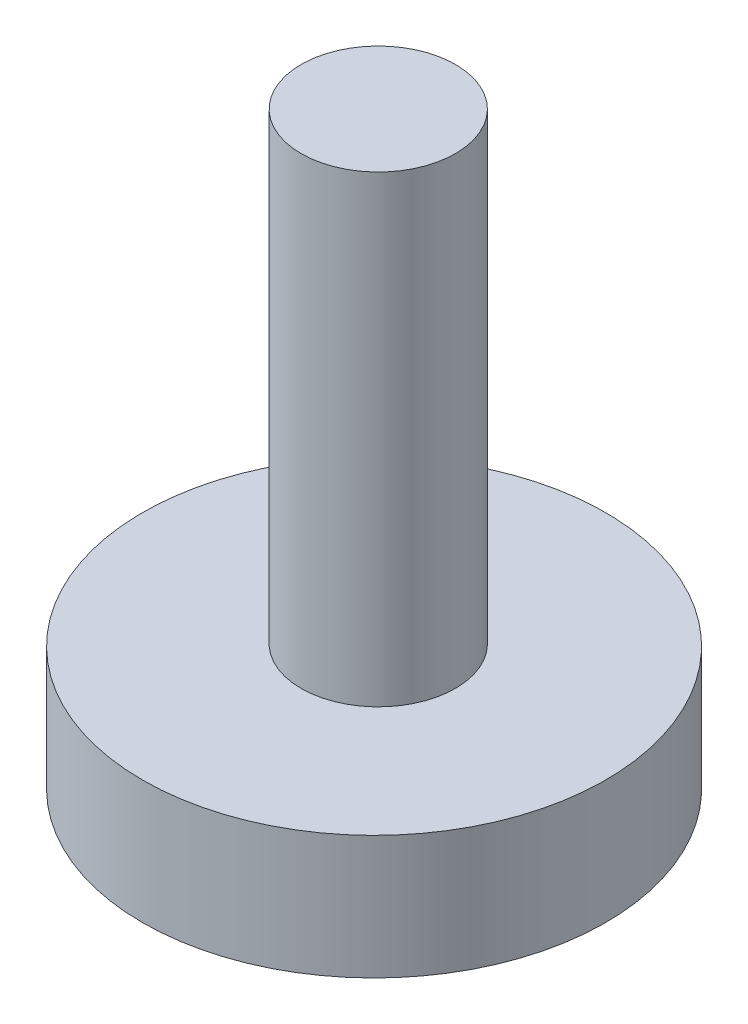
ISO-10303-21;
HEADER;
FILE_DESCRIPTION(('STEP AP214'),'2;1');
FILE_NAME('part.step','',(''),(''),'','','');
FILE_SCHEMA(('AUTOMOTIVE_DESIGN { 1 0 10303 214 1 1 1 1 }'));
ENDSEC;
DATA;
#1=APPLICATION_CONTEXT('core data for automotive mechanical design processes');
#2=APPLICATION_PROTOCOL_DEFINITION('international standard','automotive_design',2000,#1);
#3=PRODUCT_CONTEXT('',#1,'mechanical');
#4=PRODUCT('Part','Part','',(#3));
#5=PRODUCT_RELATED_PRODUCT_CATEGORY('part','',(#4));
#6=PRODUCT_DEFINITION_FORMATION('','',#4);
#7=PRODUCT_DEFINITION_CONTEXT('part definition',#1,'design');
#8=PRODUCT_DEFINITION('design','',#6,#7);
#9=PRODUCT_DEFINITION_SHAPE('','',#8);
#10=(LENGTH_UNIT() NAMED_UNIT(*) SI_UNIT(.MILLI.,.METRE.));
#11=(NAMED_UNIT(*) PLANE_ANGLE_UNIT() SI_UNIT($,.RADIAN.));
#12=(NAMED_UNIT(*) SI_UNIT($,.STERADIAN.) SOLID_ANGLE_UNIT());
#13=UNCERTAINTY_MEASURE_WITH_UNIT(LENGTH_MEASURE(1.E-05),#10,'distance_accuracy_value','');
#14=(GEOMETRIC_REPRESENTATION_CONTEXT(3) GLOBAL_UNCERTAINTY_ASSIGNED_CONTEXT((#13)) GLOBAL_UNIT_ASSIGNED_CONTEXT((#10,
#11,#12)) REPRESENTATION_CONTEXT('',''));
#15=CARTESIAN_POINT('',(0.,0.,0.));
#16=DIRECTION('',(0.,0.,1.));
#17=DIRECTION('',(1.,0.,0.));
#18=AXIS2_PLACEMENT_3D('',#15,#16,#17);
#19=CARTESIAN_POINT('',(0.,4.,0.));
#20=DIRECTION('',(0.,1.,0.));
#21=DIRECTION('',(0.,0.,1.));
#22=AXIS2_PLACEMENT_3D('',#19,#20,#21);
#23=PLANE('',#22);
#24=CARTESIAN_POINT('',(0.,4.,0.));
#25=DIRECTION('',(0.,1.,0.));
#26=DIRECTION('',(0.,0.,1.));
#27=AXIS2_PLACEMENT_3D('',#24,#25,#26);
#28=CIRCLE('',#27,7.5);
#29=CARTESIAN_POINT('',(0.,4.,7.5));
#30=VERTEX_POINT('',#29);
#31=EDGE_CURVE('E10',#30,#30,#28,.T.);
#32=ORIENTED_EDGE('',*,*,#31,.T.);
#33=EDGE_LOOP('',(#32));
#34=FACE_BOUND('',#33,.T.);
#35=CARTESIAN_POINT('',(0.,4.,-0.136309695628481));
#36=DIRECTION('',(0.,1.,0.));
#37=DIRECTION('',(0.,0.,1.));
#38=AXIS2_PLACEMENT_3D('',#35,#36,#37);
#39=CIRCLE('',#38,2.5);
#40=CARTESIAN_POINT('',(0.,4.,2.36369030437152));
#41=VERTEX_POINT('',#40);
#42=EDGE_CURVE('E46',#41,#41,#39,.T.);
#43=ORIENTED_EDGE('',*,*,#42,.F.);
#44=EDGE_LOOP('',(#43));
#45=FACE_BOUND('',#44,.T.);
#46=ADVANCED_FACE('F33',(#34,#45),#23,.T.);
#47=CARTESIAN_POINT('',(0.,4.,0.));
#48=DIRECTION('',(0.,-1.,0.));
#49=DIRECTION('',(0.,0.,-1.));
#50=AXIS2_PLACEMENT_3D('',#47,#48,#49);
#51=CYLINDRICAL_SURFACE('',#50,7.5);
#52=ORIENTED_EDGE('',*,*,#31,.F.);
#53=EDGE_LOOP('',(#52));
#54=FACE_BOUND('',#53,.T.);
#55=CARTESIAN_POINT('',(0.,0.,0.));
#56=DIRECTION('',(0.,1.,0.));
#57=DIRECTION('',(0.,0.,1.));
#58=AXIS2_PLACEMENT_3D('',#55,#56,#57);
#59=CIRCLE('',#58,7.5);
#60=CARTESIAN_POINT('',(0.,0.,7.5));
#61=VERTEX_POINT('',#60);
#62=EDGE_CURVE('E37',#61,#61,#59,.T.);
#63=ORIENTED_EDGE('',*,*,#62,.T.);
#64=EDGE_LOOP('',(#63));
#65=FACE_BOUND('',#64,.T.);
#66=ADVANCED_FACE('F35',(#54,#65),#51,.T.);
#67=CARTESIAN_POINT('',(0.,0.,0.));
#68=DIRECTION('',(0.,1.,0.));
#69=DIRECTION('',(0.,0.,1.));
#70=AXIS2_PLACEMENT_3D('',#67,#68,#69);
#71=PLANE('',#70);
#72=ORIENTED_EDGE('',*,*,#62,.F.);
#73=EDGE_LOOP('',(#72));
#74=FACE_BOUND('',#73,.T.);
#75=ADVANCED_FACE('F57',(#74),#71,.F.);
#76=CARTESIAN_POINT('',(0.,19.,-0.136309695628481));
#77=DIRECTION('',(0.,-1.,0.));
#78=DIRECTION('',(0.,0.,-1.));
#79=AXIS2_PLACEMENT_3D('',#76,#77,#78);
#80=CYLINDRICAL_SURFACE('',#79,2.5);
#81=CARTESIAN_POINT('',(0.,19.,-0.136309695628481));
#82=DIRECTION('',(0.,1.,0.));
#83=DIRECTION('',(0.,0.,1.));
#84=AXIS2_PLACEMENT_3D('',#81,#82,#83);
#85=CIRCLE('',#84,2.5);
#86=CARTESIAN_POINT('',(0.,19.,2.36369030437152));
#87=VERTEX_POINT('',#86);
#88=EDGE_CURVE('E44',#87,#87,#85,.T.);
#89=ORIENTED_EDGE('',*,*,#88,.F.);
#90=EDGE_LOOP('',(#89));
#91=FACE_BOUND('',#90,.T.);
#92=ORIENTED_EDGE('',*,*,#42,.T.);
#93=EDGE_LOOP('',(#92));
#94=FACE_BOUND('',#93,.T.);
#95=ADVANCED_FACE('F54',(#91,#94),#80,.T.);
#96=CARTESIAN_POINT('',(0.,19.,-0.136309695628481));
#97=DIRECTION('',(0.,1.,0.));
#98=DIRECTION('',(0.,0.,1.));
#99=AXIS2_PLACEMENT_3D('',#96,#97,#98);
#100=PLANE('',#99);
#101=ORIENTED_EDGE('',*,*,#88,.T.);
#102=EDGE_LOOP('',(#101));
#103=FACE_BOUND('',#102,.T.);
#104=ADVANCED_FACE('F52',(#103),#100,.T.);
#105=CLOSED_SHELL('',(#46,#66,#75,#95,#104));
#106=MANIFOLD_SOLID_BREP('B2',#105);
#107=ADVANCED_BREP_SHAPE_REPRESENTATION('',(#18,#106),#14);
#108=SHAPE_DEFINITION_REPRESENTATION(#9,#107);
ENDSEC;
END-ISO-10303-21;
